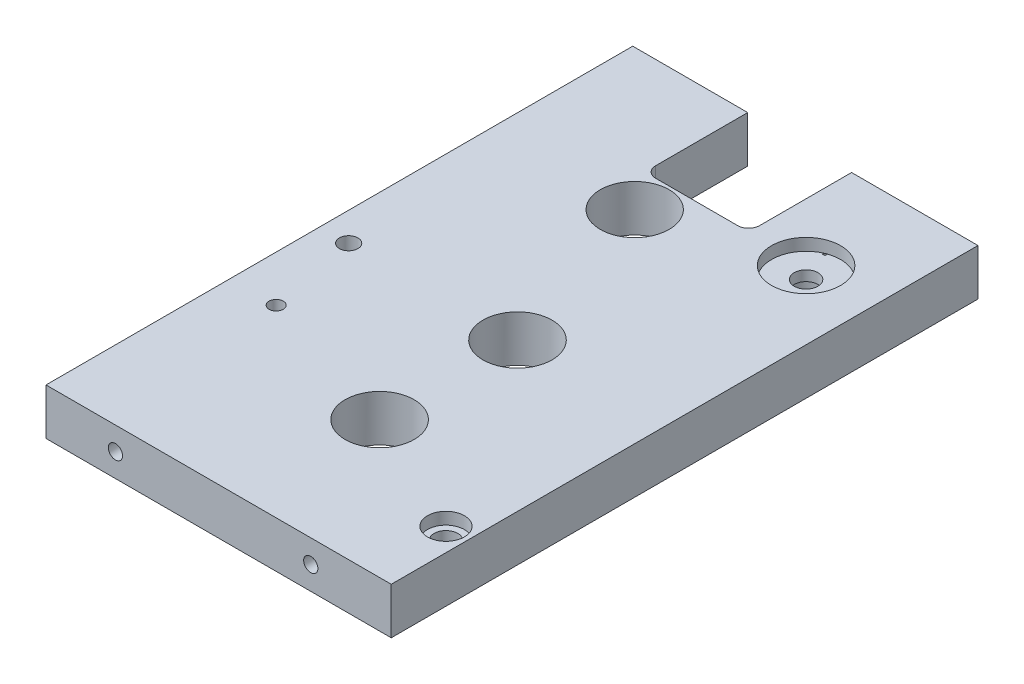
ISO-10303-21;
HEADER;
FILE_DESCRIPTION(('STEP AP214'),'2;1');
FILE_NAME('part.step','',(''),(''),'','','');
FILE_SCHEMA(('AUTOMOTIVE_DESIGN { 1 0 10303 214 1 1 1 1 }'));
ENDSEC;
DATA;
#1=APPLICATION_CONTEXT('core data for automotive mechanical design processes');
#2=APPLICATION_PROTOCOL_DEFINITION('international standard','automotive_design',2000,#1);
#3=PRODUCT_CONTEXT('',#1,'mechanical');
#4=PRODUCT('Part','Part','',(#3));
#5=PRODUCT_RELATED_PRODUCT_CATEGORY('part','',(#4));
#6=PRODUCT_DEFINITION_FORMATION('','',#4);
#7=PRODUCT_DEFINITION_CONTEXT('part definition',#1,'design');
#8=PRODUCT_DEFINITION('design','',#6,#7);
#9=PRODUCT_DEFINITION_SHAPE('','',#8);
#10=(LENGTH_UNIT() NAMED_UNIT(*) SI_UNIT(.MILLI.,.METRE.));
#11=(NAMED_UNIT(*) PLANE_ANGLE_UNIT() SI_UNIT($,.RADIAN.));
#12=(NAMED_UNIT(*) SI_UNIT($,.STERADIAN.) SOLID_ANGLE_UNIT());
#13=UNCERTAINTY_MEASURE_WITH_UNIT(LENGTH_MEASURE(1.E-05),#10,'distance_accuracy_value','');
#14=(GEOMETRIC_REPRESENTATION_CONTEXT(3) GLOBAL_UNCERTAINTY_ASSIGNED_CONTEXT((#13)) GLOBAL_UNIT_ASSIGNED_CONTEXT((#10,
#11,#12)) REPRESENTATION_CONTEXT('',''));
#15=CARTESIAN_POINT('',(0.,0.,0.));
#16=DIRECTION('',(0.,0.,1.));
#17=DIRECTION('',(1.,0.,0.));
#18=AXIS2_PLACEMENT_3D('',#15,#16,#17);
#19=CARTESIAN_POINT('',(-253.55,-622.901,28.505));
#20=DIRECTION('',(0.,1.,0.));
#21=DIRECTION('',(0.,0.,1.));
#22=AXIS2_PLACEMENT_3D('',#19,#20,#21);
#23=CYLINDRICAL_SURFACE('',#22,3.26500000000004);
#24=CARTESIAN_POINT('',(-253.55,-613.42,28.505));
#25=DIRECTION('',(0.,1.,0.));
#26=DIRECTION('',(0.,0.,1.));
#27=AXIS2_PLACEMENT_3D('',#24,#25,#26);
#28=CIRCLE('',#27,3.26500000000004);
#29=CARTESIAN_POINT('',(-253.55,-613.42,31.77));
#30=VERTEX_POINT('',#29);
#31=EDGE_CURVE('E132',#30,#30,#28,.F.);
#32=ORIENTED_EDGE('',*,*,#31,.F.);
#33=EDGE_LOOP('',(#32));
#34=FACE_BOUND('',#33,.T.);
#35=CARTESIAN_POINT('',(-253.55,-616.25,28.505));
#36=DIRECTION('',(0.,-1.,0.));
#37=DIRECTION('',(0.,0.,-1.));
#38=AXIS2_PLACEMENT_3D('',#35,#36,#37);
#39=CIRCLE('',#38,3.26500000000004);
#40=CARTESIAN_POINT('',(-253.55,-616.25,25.24));
#41=VERTEX_POINT('',#40);
#42=EDGE_CURVE('E37',#41,#41,#39,.F.);
#43=ORIENTED_EDGE('',*,*,#42,.F.);
#44=EDGE_LOOP('',(#43));
#45=FACE_BOUND('',#44,.T.);
#46=ADVANCED_FACE('F33',(#34,#45),#23,.F.);
#47=CARTESIAN_POINT('',(-240.925,-622.901,140.49));
#48=DIRECTION('',(0.,1.,0.));
#49=DIRECTION('',(0.,0.,1.));
#50=AXIS2_PLACEMENT_3D('',#47,#48,#49);
#51=CYLINDRICAL_SURFACE('',#50,3.26500000000004);
#52=CARTESIAN_POINT('',(-240.925,-613.42,140.49));
#53=DIRECTION('',(0.,1.,0.));
#54=DIRECTION('',(0.,0.,1.));
#55=AXIS2_PLACEMENT_3D('',#52,#53,#54);
#56=CIRCLE('',#55,3.26500000000004);
#57=CARTESIAN_POINT('',(-240.925,-613.42,143.755));
#58=VERTEX_POINT('',#57);
#59=EDGE_CURVE('E271',#58,#58,#56,.F.);
#60=ORIENTED_EDGE('',*,*,#59,.F.);
#61=EDGE_LOOP('',(#60));
#62=FACE_BOUND('',#61,.T.);
#63=CARTESIAN_POINT('',(-240.925,-616.25,140.49));
#64=DIRECTION('',(0.,-1.,0.));
#65=DIRECTION('',(0.,0.,-1.));
#66=AXIS2_PLACEMENT_3D('',#63,#64,#65);
#67=CIRCLE('',#66,3.26500000000004);
#68=CARTESIAN_POINT('',(-240.925,-616.25,137.225));
#69=VERTEX_POINT('',#68);
#70=EDGE_CURVE('E358',#69,#69,#67,.F.);
#71=ORIENTED_EDGE('',*,*,#70,.F.);
#72=EDGE_LOOP('',(#71));
#73=FACE_BOUND('',#72,.T.);
#74=ADVANCED_FACE('F292',(#62,#73),#51,.F.);
#75=CARTESIAN_POINT('',(-257.,-616.5,20.2));
#76=DIRECTION('',(0.,0.,-1.));
#77=DIRECTION('',(-1.,0.,0.));
#78=AXIS2_PLACEMENT_3D('',#75,#76,#77);
#79=CYLINDRICAL_SURFACE('',#78,3.1);
#80=CARTESIAN_POINT('',(-257.,-616.5,0.));
#81=DIRECTION('',(0.,0.,1.));
#82=DIRECTION('',(1.,0.,0.));
#83=AXIS2_PLACEMENT_3D('',#80,#81,#82);
#84=CIRCLE('',#83,3.1);
#85=CARTESIAN_POINT('',(-253.9,-616.5,0.));
#86=VERTEX_POINT('',#85);
#87=EDGE_CURVE('E218',#86,#86,#84,.T.);
#88=ORIENTED_EDGE('',*,*,#87,.F.);
#89=EDGE_LOOP('',(#88));
#90=FACE_BOUND('',#89,.T.);
#91=CARTESIAN_POINT('',(-257.,-616.5,20.2));
#92=DIRECTION('',(0.,0.,1.));
#93=DIRECTION('',(1.,0.,0.));
#94=AXIS2_PLACEMENT_3D('',#91,#92,#93);
#95=CIRCLE('',#94,3.1);
#96=CARTESIAN_POINT('',(-257.351567916625,-613.42,20.2));
#97=VERTEX_POINT('',#96);
#98=CARTESIAN_POINT('',(-256.648432083375,-613.42,20.2));
#99=VERTEX_POINT('',#98);
#100=EDGE_CURVE('E138',#97,#99,#95,.T.);
#101=ORIENTED_EDGE('',*,*,#100,.T.);
#102=DIRECTION('',(0.,0.,-1.));
#103=VECTOR('',#102,1.);
#104=CARTESIAN_POINT('',(-256.648432083375,-613.42,20.2));
#105=LINE('',#104,#103);
#106=CARTESIAN_POINT('',(-256.648432083375,-613.42,19.4980391571455));
#107=VERTEX_POINT('',#106);
#108=EDGE_CURVE('E50',#99,#107,#105,.T.);
#109=ORIENTED_EDGE('',*,*,#108,.T.);
#110=CARTESIAN_POINT('',(-257.351567916625,-613.42,19.7715180841038));
#111=CARTESIAN_POINT('',(-257.294025252139,-613.413430428197,19.7464680719644));
#112=CARTESIAN_POINT('',(-257.236076859942,-613.40845092462,19.7219228697342));
#113=CARTESIAN_POINT('',(-257.119730101556,-613.401767055608,19.6739985155621));
#114=CARTESIAN_POINT('',(-257.061333756756,-613.400052307867,19.6506158982737));
#115=CARTESIAN_POINT('',(-256.944081841742,-613.399950057355,19.6050118117245));
#116=CARTESIAN_POINT('',(-256.885226256778,-613.401562661886,19.5827903799339));
#117=CARTESIAN_POINT('',(-256.767068214502,-613.408194942094,19.5395060983339));
#118=CARTESIAN_POINT('',(-256.707764930181,-613.413225489289,19.5184471779447));
#119=CARTESIAN_POINT('',(-256.648432083375,-613.42,19.4980391571455));
#120=B_SPLINE_CURVE_WITH_KNOTS('',3,(#110,#111,#112,#113,#114,#115,#116,#117,#118,#119),
.UNSPECIFIED.,.F.,.F.,(4,2,2,2,4),(0.,0.18928759541192,0.377972222019606,0.566662933511772,
0.755956644415914),.UNSPECIFIED.);
#121=CARTESIAN_POINT('',(-257.351567916625,-613.42,19.7715180841038));
#122=VERTEX_POINT('',#121);
#123=EDGE_CURVE('E11',#122,#107,#120,.T.);
#124=ORIENTED_EDGE('',*,*,#123,.F.);
#125=DIRECTION('',(0.,0.,-1.));
#126=VECTOR('',#125,1.);
#127=CARTESIAN_POINT('',(-257.351567916625,-613.42,20.2));
#128=LINE('',#127,#126);
#129=EDGE_CURVE('E131',#122,#97,#128,.F.);
#130=ORIENTED_EDGE('',*,*,#129,.T.);
#131=EDGE_LOOP('',(#101,#109,#124,#130));
#132=FACE_BOUND('',#131,.T.);
#133=ADVANCED_FACE('F136',(#90,#132),#79,.F.);
#134=CARTESIAN_POINT('',(-282.25,-691.394504988286,20.2));
#135=DIRECTION('',(0.,0.,1.));
#136=DIRECTION('',(1.,0.,0.));
#137=AXIS2_PLACEMENT_3D('',#134,#135,#136);
#138=PLANE('',#137);
#139=DIRECTION('',(-1.,0.,0.));
#140=VECTOR('',#139,1.);
#141=CARTESIAN_POINT('',(-282.25,-613.42,20.2));
#142=LINE('',#141,#140);
#143=EDGE_CURVE('E144',#99,#97,#142,.T.);
#144=ORIENTED_EDGE('',*,*,#143,.F.);
#145=ORIENTED_EDGE('',*,*,#100,.F.);
#146=EDGE_LOOP('',(#144,#145));
#147=FACE_BOUND('',#146,.T.);
#148=ADVANCED_FACE('F339',(#147),#138,.F.);
#149=CARTESIAN_POINT('',(-329.875,-610.1,0.));
#150=DIRECTION('',(0.,0.,1.));
#151=DIRECTION('',(1.,0.,0.));
#152=AXIS2_PLACEMENT_3D('',#149,#150,#151);
#153=PLANE('',#152);
#154=ORIENTED_EDGE('',*,*,#87,.T.);
#155=EDGE_LOOP('',(#154));
#156=FACE_BOUND('',#155,.T.);
#157=CARTESIAN_POINT('',(-244.2,-616.5,0.));
#158=DIRECTION('',(0.,0.,1.));
#159=DIRECTION('',(1.,0.,0.));
#160=AXIS2_PLACEMENT_3D('',#157,#158,#159);
#161=CIRCLE('',#160,2.39500000000001);
#162=CARTESIAN_POINT('',(-241.805,-616.5,0.));
#163=VERTEX_POINT('',#162);
#164=EDGE_CURVE('E212',#163,#163,#161,.T.);
#165=ORIENTED_EDGE('',*,*,#164,.T.);
#166=EDGE_LOOP('',(#165));
#167=FACE_BOUND('',#166,.T.);
#168=DIRECTION('',(-1.,0.,0.));
#169=VECTOR('',#168,1.);
#170=CARTESIAN_POINT('',(-234.625,-622.9,0.));
#171=LINE('',#170,#169);
#172=CARTESIAN_POINT('',(-234.625,-622.9,0.));
#173=VERTEX_POINT('',#172);
#174=CARTESIAN_POINT('',(-269.505,-622.9,0.));
#175=VERTEX_POINT('',#174);
#176=EDGE_CURVE('E251',#173,#175,#171,.T.);
#177=ORIENTED_EDGE('',*,*,#176,.T.);
#178=DIRECTION('',(0.,1.,0.));
#179=VECTOR('',#178,1.);
#180=CARTESIAN_POINT('',(-269.505,-622.901,0.));
#181=LINE('',#180,#179);
#182=CARTESIAN_POINT('',(-269.505,-610.1,0.));
#183=VERTEX_POINT('',#182);
#184=EDGE_CURVE('E184',#175,#183,#181,.T.);
#185=ORIENTED_EDGE('',*,*,#184,.T.);
#186=DIRECTION('',(-1.,0.,0.));
#187=VECTOR('',#186,1.);
#188=CARTESIAN_POINT('',(-234.625,-610.1,0.));
#189=LINE('',#188,#187);
#190=CARTESIAN_POINT('',(-234.625,-610.1,0.));
#191=VERTEX_POINT('',#190);
#192=EDGE_CURVE('E244',#191,#183,#189,.T.);
#193=ORIENTED_EDGE('',*,*,#192,.F.);
#194=DIRECTION('',(0.,-1.,0.));
#195=VECTOR('',#194,1.);
#196=CARTESIAN_POINT('',(-234.625,-610.1,0.));
#197=LINE('',#196,#195);
#198=EDGE_CURVE('E235',#191,#173,#197,.T.);
#199=ORIENTED_EDGE('',*,*,#198,.T.);
#200=EDGE_LOOP('',(#177,#185,#193,#199));
#201=FACE_BOUND('',#200,.T.);
#202=ADVANCED_FACE('F341',(#156,#167,#201),#153,.F.);
#203=CARTESIAN_POINT('',(-307.5,-616.5,0.));
#204=DIRECTION('',(0.,0.,1.));
#205=DIRECTION('',(1.,0.,0.));
#206=AXIS2_PLACEMENT_3D('',#203,#204,#205);
#207=CIRCLE('',#206,3.1);
#208=CARTESIAN_POINT('',(-304.4,-616.5,0.));
#209=VERTEX_POINT('',#208);
#210=EDGE_CURVE('E222',#209,#209,#207,.T.);
#211=ORIENTED_EDGE('',*,*,#210,.T.);
#212=EDGE_LOOP('',(#211));
#213=FACE_BOUND('',#212,.T.);
#214=CARTESIAN_POINT('',(-298.155,-610.1,0.));
#215=VERTEX_POINT('',#214);
#216=CARTESIAN_POINT('',(-329.875,-610.1,0.));
#217=VERTEX_POINT('',#216);
#218=EDGE_CURVE('E228',#215,#217,#189,.T.);
#219=ORIENTED_EDGE('',*,*,#218,.F.);
#220=DIRECTION('',(0.,1.,0.));
#221=VECTOR('',#220,1.);
#222=CARTESIAN_POINT('',(-298.155,-622.901,0.));
#223=LINE('',#222,#221);
#224=CARTESIAN_POINT('',(-298.155,-622.9,0.));
#225=VERTEX_POINT('',#224);
#226=EDGE_CURVE('E193',#225,#215,#223,.T.);
#227=ORIENTED_EDGE('',*,*,#226,.F.);
#228=CARTESIAN_POINT('',(-329.875,-622.9,0.));
#229=VERTEX_POINT('',#228);
#230=EDGE_CURVE('E250',#225,#229,#171,.T.);
#231=ORIENTED_EDGE('',*,*,#230,.T.);
#232=DIRECTION('',(0.,-1.,0.));
#233=VECTOR('',#232,1.);
#234=CARTESIAN_POINT('',(-329.875,-610.1,0.));
#235=LINE('',#234,#233);
#236=EDGE_CURVE('E247',#217,#229,#235,.T.);
#237=ORIENTED_EDGE('',*,*,#236,.F.);
#238=EDGE_LOOP('',(#219,#227,#231,#237));
#239=FACE_BOUND('',#238,.T.);
#240=CARTESIAN_POINT('',(-320.5,-616.5,0.));
#241=DIRECTION('',(0.,0.,1.));
#242=DIRECTION('',(1.,0.,0.));
#243=AXIS2_PLACEMENT_3D('',#240,#241,#242);
#244=CIRCLE('',#243,2.39499999999998);
#245=CARTESIAN_POINT('',(-318.105,-616.5,0.));
#246=VERTEX_POINT('',#245);
#247=EDGE_CURVE('E206',#246,#246,#244,.T.);
#248=ORIENTED_EDGE('',*,*,#247,.T.);
#249=EDGE_LOOP('',(#248));
#250=FACE_BOUND('',#249,.T.);
#251=ADVANCED_FACE('F347',(#213,#239,#250),#153,.F.);
#252=CARTESIAN_POINT('',(-234.625,-610.1,161.88));
#253=DIRECTION('',(0.,-1.,0.));
#254=DIRECTION('',(0.,0.,-1.));
#255=AXIS2_PLACEMENT_3D('',#252,#253,#254);
#256=PLANE('',#255);
#257=CARTESIAN_POINT('',(-290.57,-610.1,38.77));
#258=DIRECTION('',(0.,-1.,0.));
#259=DIRECTION('',(0.,0.,-1.));
#260=AXIS2_PLACEMENT_3D('',#257,#258,#259);
#261=CIRCLE('',#260,9.50000000000001);
#262=CARTESIAN_POINT('',(-290.57,-610.1,29.27));
#263=VERTEX_POINT('',#262);
#264=EDGE_CURVE('E389',#263,#263,#261,.T.);
#265=ORIENTED_EDGE('',*,*,#264,.T.);
#266=EDGE_LOOP('',(#265));
#267=FACE_BOUND('',#266,.T.);
#268=CARTESIAN_POINT('',(-240.925,-610.1,140.49));
#269=DIRECTION('',(0.,1.,0.));
#270=DIRECTION('',(0.,0.,1.));
#271=AXIS2_PLACEMENT_3D('',#268,#269,#270);
#272=CIRCLE('',#271,5.09);
#273=CARTESIAN_POINT('',(-240.925,-610.1,145.58));
#274=VERTEX_POINT('',#273);
#275=EDGE_CURVE('E354',#274,#274,#272,.T.);
#276=ORIENTED_EDGE('',*,*,#275,.F.);
#277=EDGE_LOOP('',(#276));
#278=FACE_BOUND('',#277,.T.);
#279=CARTESIAN_POINT('',(-253.55,-610.1,28.505));
#280=DIRECTION('',(0.,1.,0.));
#281=DIRECTION('',(0.,0.,1.));
#282=AXIS2_PLACEMENT_3D('',#279,#280,#281);
#283=CIRCLE('',#282,9.52500000000002);
#284=CARTESIAN_POINT('',(-253.55,-610.1,38.03));
#285=VERTEX_POINT('',#284);
#286=EDGE_CURVE('E133',#285,#285,#283,.T.);
#287=ORIENTED_EDGE('',*,*,#286,.F.);
#288=EDGE_LOOP('',(#287));
#289=FACE_BOUND('',#288,.T.);
#290=CARTESIAN_POINT('',(-321.975,-610.1,86.28));
#291=DIRECTION('',(0.,1.,0.));
#292=DIRECTION('',(0.,0.,1.));
#293=AXIS2_PLACEMENT_3D('',#290,#291,#292);
#294=CIRCLE('',#293,2.56000000000003);
#295=CARTESIAN_POINT('',(-321.975,-610.1,88.84));
#296=VERTEX_POINT('',#295);
#297=EDGE_CURVE('E142',#296,#296,#294,.T.);
#298=ORIENTED_EDGE('',*,*,#297,.F.);
#299=EDGE_LOOP('',(#298));
#300=FACE_BOUND('',#299,.T.);
#301=CARTESIAN_POINT('',(-317.175,-610.1,111.08));
#302=DIRECTION('',(0.,1.,0.));
#303=DIRECTION('',(0.,0.,1.));
#304=AXIS2_PLACEMENT_3D('',#301,#302,#303);
#305=CIRCLE('',#304,1.96000000000001);
#306=CARTESIAN_POINT('',(-317.175,-610.1,113.04));
#307=VERTEX_POINT('',#306);
#308=EDGE_CURVE('E151',#307,#307,#305,.T.);
#309=ORIENTED_EDGE('',*,*,#308,.F.);
#310=EDGE_LOOP('',(#309));
#311=FACE_BOUND('',#310,.T.);
#312=CARTESIAN_POINT('',(-275.57,-610.1,86.105));
#313=DIRECTION('',(0.,1.,0.));
#314=DIRECTION('',(0.,0.,1.));
#315=AXIS2_PLACEMENT_3D('',#312,#313,#314);
#316=CIRCLE('',#315,9.52500000000002);
#317=CARTESIAN_POINT('',(-275.57,-610.1,95.63));
#318=VERTEX_POINT('',#317);
#319=EDGE_CURVE('E197',#318,#318,#316,.T.);
#320=ORIENTED_EDGE('',*,*,#319,.F.);
#321=EDGE_LOOP('',(#320));
#322=FACE_BOUND('',#321,.T.);
#323=CARTESIAN_POINT('',(-275.57,-610.1,124.135));
#324=DIRECTION('',(0.,1.,0.));
#325=DIRECTION('',(0.,0.,1.));
#326=AXIS2_PLACEMENT_3D('',#323,#324,#325);
#327=CIRCLE('',#326,9.52500000000002);
#328=CARTESIAN_POINT('',(-275.57,-610.1,133.66));
#329=VERTEX_POINT('',#328);
#330=EDGE_CURVE('E203',#329,#329,#327,.T.);
#331=ORIENTED_EDGE('',*,*,#330,.F.);
#332=EDGE_LOOP('',(#331));
#333=FACE_BOUND('',#332,.T.);
#334=ORIENTED_EDGE('',*,*,#192,.T.);
#335=DIRECTION('',(0.,0.,-1.));
#336=VECTOR('',#335,1.);
#337=CARTESIAN_POINT('',(-269.505,-610.1,0.));
#338=LINE('',#337,#336);
#339=CARTESIAN_POINT('',(-269.505,-610.1,25.4));
#340=VERTEX_POINT('',#339);
#341=EDGE_CURVE('E171',#340,#183,#338,.T.);
#342=ORIENTED_EDGE('',*,*,#341,.F.);
#343=CARTESIAN_POINT('',(-272.505,-610.1,25.4));
#344=DIRECTION('',(0.,1.,0.));
#345=DIRECTION('',(0.,0.,1.));
#346=AXIS2_PLACEMENT_3D('',#343,#344,#345);
#347=CIRCLE('',#346,3.);
#348=CARTESIAN_POINT('',(-272.505,-610.1,28.4));
#349=VERTEX_POINT('',#348);
#350=EDGE_CURVE('E181',#349,#340,#347,.T.);
#351=ORIENTED_EDGE('',*,*,#350,.F.);
#352=DIRECTION('',(1.,0.,0.));
#353=VECTOR('',#352,1.);
#354=CARTESIAN_POINT('',(-272.505,-610.1,28.4));
#355=LINE('',#354,#353);
#356=CARTESIAN_POINT('',(-295.155,-610.1,28.4));
#357=VERTEX_POINT('',#356);
#358=EDGE_CURVE('E178',#357,#349,#355,.T.);
#359=ORIENTED_EDGE('',*,*,#358,.F.);
#360=CARTESIAN_POINT('',(-295.155,-610.1,25.4));
#361=DIRECTION('',(0.,1.,0.));
#362=DIRECTION('',(0.,0.,1.));
#363=AXIS2_PLACEMENT_3D('',#360,#361,#362);
#364=CIRCLE('',#363,3.);
#365=CARTESIAN_POINT('',(-298.155,-610.1,25.4));
#366=VERTEX_POINT('',#365);
#367=EDGE_CURVE('E175',#366,#357,#364,.T.);
#368=ORIENTED_EDGE('',*,*,#367,.F.);
#369=DIRECTION('',(0.,0.,1.));
#370=VECTOR('',#369,1.);
#371=CARTESIAN_POINT('',(-298.155,-610.1,0.));
#372=LINE('',#371,#370);
#373=EDGE_CURVE('E173',#215,#366,#372,.T.);
#374=ORIENTED_EDGE('',*,*,#373,.F.);
#375=ORIENTED_EDGE('',*,*,#218,.T.);
#376=DIRECTION('',(0.,0.,-1.));
#377=VECTOR('',#376,1.);
#378=CARTESIAN_POINT('',(-329.875,-610.1,161.88));
#379=LINE('',#378,#377);
#380=CARTESIAN_POINT('',(-329.875,-610.1,161.88));
#381=VERTEX_POINT('',#380);
#382=EDGE_CURVE('E42',#381,#217,#379,.T.);
#383=ORIENTED_EDGE('',*,*,#382,.F.);
#384=DIRECTION('',(-1.,0.,0.));
#385=VECTOR('',#384,1.);
#386=CARTESIAN_POINT('',(-234.625,-610.1,161.88));
#387=LINE('',#386,#385);
#388=CARTESIAN_POINT('',(-234.625,-610.1,161.88));
#389=VERTEX_POINT('',#388);
#390=EDGE_CURVE('E231',#389,#381,#387,.T.);
#391=ORIENTED_EDGE('',*,*,#390,.F.);
#392=DIRECTION('',(0.,0.,-1.));
#393=VECTOR('',#392,1.);
#394=CARTESIAN_POINT('',(-234.625,-610.1,161.88));
#395=LINE('',#394,#393);
#396=EDGE_CURVE('E243',#389,#191,#395,.T.);
#397=ORIENTED_EDGE('',*,*,#396,.T.);
#398=EDGE_LOOP('',(#334,#342,#351,#359,#368,#374,#375,#383,#391,#397));
#399=FACE_BOUND('',#398,.T.);
#400=ADVANCED_FACE('F35',(#267,#278,#289,#300,#311,#322,#333,#399),#256,.F.);
#401=CARTESIAN_POINT('',(-329.875,-610.1,161.88));
#402=DIRECTION('',(1.,0.,0.));
#403=DIRECTION('',(0.,0.,-1.));
#404=AXIS2_PLACEMENT_3D('',#401,#402,#403);
#405=PLANE('',#404);
#406=CARTESIAN_POINT('',(-329.875,-616.5,142.28));
#407=DIRECTION('',(-1.,0.,0.));
#408=DIRECTION('',(0.,0.,1.));
#409=AXIS2_PLACEMENT_3D('',#406,#407,#408);
#410=CIRCLE('',#409,1.9699999999999);
#411=CARTESIAN_POINT('',(-329.875,-616.5,144.25));
#412=VERTEX_POINT('',#411);
#413=EDGE_CURVE('E386',#412,#412,#410,.T.);
#414=ORIENTED_EDGE('',*,*,#413,.F.);
#415=EDGE_LOOP('',(#414));
#416=FACE_BOUND('',#415,.T.);
#417=ORIENTED_EDGE('',*,*,#236,.T.);
#418=DIRECTION('',(0.,0.,-1.));
#419=VECTOR('',#418,1.);
#420=CARTESIAN_POINT('',(-329.875,-622.9,161.88));
#421=LINE('',#420,#419);
#422=CARTESIAN_POINT('',(-329.875,-622.9,161.88));
#423=VERTEX_POINT('',#422);
#424=EDGE_CURVE('E259',#423,#229,#421,.T.);
#425=ORIENTED_EDGE('',*,*,#424,.F.);
#426=DIRECTION('',(0.,-1.,0.));
#427=VECTOR('',#426,1.);
#428=CARTESIAN_POINT('',(-329.875,-610.1,161.88));
#429=LINE('',#428,#427);
#430=EDGE_CURVE('E234',#381,#423,#429,.T.);
#431=ORIENTED_EDGE('',*,*,#430,.F.);
#432=ORIENTED_EDGE('',*,*,#382,.T.);
#433=EDGE_LOOP('',(#417,#425,#431,#432));
#434=FACE_BOUND('',#433,.T.);
#435=ADVANCED_FACE('F411',(#416,#434),#405,.F.);
#436=CARTESIAN_POINT('',(-234.625,-622.9,161.88));
#437=DIRECTION('',(0.,-1.,0.));
#438=DIRECTION('',(0.,0.,-1.));
#439=AXIS2_PLACEMENT_3D('',#436,#437,#438);
#440=PLANE('',#439);
#441=CARTESIAN_POINT('',(-290.57,-622.9,38.77));
#442=DIRECTION('',(0.,-1.,0.));
#443=DIRECTION('',(0.,0.,-1.));
#444=AXIS2_PLACEMENT_3D('',#441,#442,#443);
#445=CIRCLE('',#444,9.50000000000001);
#446=CARTESIAN_POINT('',(-290.57,-622.9,29.27));
#447=VERTEX_POINT('',#446);
#448=EDGE_CURVE('E392',#447,#447,#445,.T.);
#449=ORIENTED_EDGE('',*,*,#448,.F.);
#450=EDGE_LOOP('',(#449));
#451=FACE_BOUND('',#450,.T.);
#452=CARTESIAN_POINT('',(-253.55,-622.9,28.505));
#453=DIRECTION('',(0.,-1.,0.));
#454=DIRECTION('',(0.,0.,-1.));
#455=AXIS2_PLACEMENT_3D('',#452,#453,#454);
#456=CIRCLE('',#455,5.31000000000001);
#457=CARTESIAN_POINT('',(-253.55,-622.9,23.195));
#458=VERTEX_POINT('',#457);
#459=EDGE_CURVE('E367',#458,#458,#456,.T.);
#460=ORIENTED_EDGE('',*,*,#459,.F.);
#461=EDGE_LOOP('',(#460));
#462=FACE_BOUND('',#461,.T.);
#463=CARTESIAN_POINT('',(-240.925,-622.9,140.49));
#464=DIRECTION('',(0.,-1.,0.));
#465=DIRECTION('',(0.,0.,-1.));
#466=AXIS2_PLACEMENT_3D('',#463,#464,#465);
#467=CIRCLE('',#466,5.31000000000002);
#468=CARTESIAN_POINT('',(-240.925,-622.9,135.18));
#469=VERTEX_POINT('',#468);
#470=EDGE_CURVE('E361',#469,#469,#467,.T.);
#471=ORIENTED_EDGE('',*,*,#470,.F.);
#472=EDGE_LOOP('',(#471));
#473=FACE_BOUND('',#472,.T.);
#474=CARTESIAN_POINT('',(-321.975,-622.9,86.28));
#475=DIRECTION('',(0.,-1.,0.));
#476=DIRECTION('',(0.,0.,-1.));
#477=AXIS2_PLACEMENT_3D('',#474,#475,#476);
#478=CIRCLE('',#477,2.56000000000003);
#479=CARTESIAN_POINT('',(-321.975,-622.9,83.72));
#480=VERTEX_POINT('',#479);
#481=EDGE_CURVE('E139',#480,#480,#478,.F.);
#482=ORIENTED_EDGE('',*,*,#481,.T.);
#483=EDGE_LOOP('',(#482));
#484=FACE_BOUND('',#483,.T.);
#485=CARTESIAN_POINT('',(-317.175,-622.9,111.08));
#486=DIRECTION('',(0.,-1.,0.));
#487=DIRECTION('',(0.,0.,-1.));
#488=AXIS2_PLACEMENT_3D('',#485,#486,#487);
#489=CIRCLE('',#488,1.96000000000001);
#490=CARTESIAN_POINT('',(-317.175,-622.9,109.12));
#491=VERTEX_POINT('',#490);
#492=EDGE_CURVE('E149',#491,#491,#489,.F.);
#493=ORIENTED_EDGE('',*,*,#492,.T.);
#494=EDGE_LOOP('',(#493));
#495=FACE_BOUND('',#494,.T.);
#496=DIRECTION('',(0.,0.,-1.));
#497=VECTOR('',#496,1.);
#498=CARTESIAN_POINT('',(-269.505,-622.9,0.));
#499=LINE('',#498,#497);
#500=CARTESIAN_POINT('',(-269.505,-622.9,25.4));
#501=VERTEX_POINT('',#500);
#502=EDGE_CURVE('E168',#501,#175,#499,.T.);
#503=ORIENTED_EDGE('',*,*,#502,.T.);
#504=ORIENTED_EDGE('',*,*,#176,.F.);
#505=DIRECTION('',(0.,0.,-1.));
#506=VECTOR('',#505,1.);
#507=CARTESIAN_POINT('',(-234.625,-622.9,161.88));
#508=LINE('',#507,#506);
#509=CARTESIAN_POINT('',(-234.625,-622.9,161.88));
#510=VERTEX_POINT('',#509);
#511=EDGE_CURVE('E257',#510,#173,#508,.T.);
#512=ORIENTED_EDGE('',*,*,#511,.F.);
#513=DIRECTION('',(-1.,0.,0.));
#514=VECTOR('',#513,1.);
#515=CARTESIAN_POINT('',(-234.625,-622.9,161.88));
#516=LINE('',#515,#514);
#517=EDGE_CURVE('E237',#510,#423,#516,.T.);
#518=ORIENTED_EDGE('',*,*,#517,.T.);
#519=ORIENTED_EDGE('',*,*,#424,.T.);
#520=ORIENTED_EDGE('',*,*,#230,.F.);
#521=DIRECTION('',(0.,0.,1.));
#522=VECTOR('',#521,1.);
#523=CARTESIAN_POINT('',(-298.155,-622.9,0.));
#524=LINE('',#523,#522);
#525=CARTESIAN_POINT('',(-298.155,-622.9,25.4));
#526=VERTEX_POINT('',#525);
#527=EDGE_CURVE('E154',#225,#526,#524,.T.);
#528=ORIENTED_EDGE('',*,*,#527,.T.);
#529=CARTESIAN_POINT('',(-295.155,-622.9,25.4));
#530=DIRECTION('',(0.,-1.,0.));
#531=DIRECTION('',(0.,0.,-1.));
#532=AXIS2_PLACEMENT_3D('',#529,#530,#531);
#533=CIRCLE('',#532,3.);
#534=CARTESIAN_POINT('',(-295.155,-622.9,28.4));
#535=VERTEX_POINT('',#534);
#536=EDGE_CURVE('E159',#526,#535,#533,.F.);
#537=ORIENTED_EDGE('',*,*,#536,.T.);
#538=DIRECTION('',(1.,0.,0.));
#539=VECTOR('',#538,1.);
#540=CARTESIAN_POINT('',(-272.505,-622.9,28.4));
#541=LINE('',#540,#539);
#542=CARTESIAN_POINT('',(-272.505,-622.9,28.4));
#543=VERTEX_POINT('',#542);
#544=EDGE_CURVE('E162',#535,#543,#541,.T.);
#545=ORIENTED_EDGE('',*,*,#544,.T.);
#546=CARTESIAN_POINT('',(-272.505,-622.9,25.4));
#547=DIRECTION('',(0.,-1.,0.));
#548=DIRECTION('',(0.,0.,-1.));
#549=AXIS2_PLACEMENT_3D('',#546,#547,#548);
#550=CIRCLE('',#549,3.);
#551=EDGE_CURVE('E165',#543,#501,#550,.F.);
#552=ORIENTED_EDGE('',*,*,#551,.T.);
#553=EDGE_LOOP('',(#503,#504,#512,#518,#519,#520,#528,#537,#545,#552));
#554=FACE_BOUND('',#553,.T.);
#555=CARTESIAN_POINT('',(-275.57,-622.9,86.105));
#556=DIRECTION('',(0.,-1.,0.));
#557=DIRECTION('',(0.,0.,-1.));
#558=AXIS2_PLACEMENT_3D('',#555,#556,#557);
#559=CIRCLE('',#558,9.52500000000002);
#560=CARTESIAN_POINT('',(-275.57,-622.9,76.58));
#561=VERTEX_POINT('',#560);
#562=EDGE_CURVE('E187',#561,#561,#559,.F.);
#563=ORIENTED_EDGE('',*,*,#562,.T.);
#564=EDGE_LOOP('',(#563));
#565=FACE_BOUND('',#564,.T.);
#566=CARTESIAN_POINT('',(-275.57,-622.9,124.135));
#567=DIRECTION('',(0.,-1.,0.));
#568=DIRECTION('',(0.,0.,-1.));
#569=AXIS2_PLACEMENT_3D('',#566,#567,#568);
#570=CIRCLE('',#569,9.52500000000002);
#571=CARTESIAN_POINT('',(-275.57,-622.9,114.61));
#572=VERTEX_POINT('',#571);
#573=EDGE_CURVE('E200',#572,#572,#570,.F.);
#574=ORIENTED_EDGE('',*,*,#573,.T.);
#575=EDGE_LOOP('',(#574));
#576=FACE_BOUND('',#575,.T.);
#577=ADVANCED_FACE('F407',(#451,#462,#473,#484,#495,#554,#565,#576),#440,.T.);
#578=CARTESIAN_POINT('',(-234.625,-610.1,161.88));
#579=DIRECTION('',(1.,0.,0.));
#580=DIRECTION('',(0.,0.,-1.));
#581=AXIS2_PLACEMENT_3D('',#578,#579,#580);
#582=PLANE('',#581);
#583=ORIENTED_EDGE('',*,*,#198,.F.);
#584=ORIENTED_EDGE('',*,*,#396,.F.);
#585=DIRECTION('',(0.,-1.,0.));
#586=VECTOR('',#585,1.);
#587=CARTESIAN_POINT('',(-234.625,-610.1,161.88));
#588=LINE('',#587,#586);
#589=EDGE_CURVE('E240',#389,#510,#588,.T.);
#590=ORIENTED_EDGE('',*,*,#589,.T.);
#591=ORIENTED_EDGE('',*,*,#511,.T.);
#592=EDGE_LOOP('',(#583,#584,#590,#591));
#593=FACE_BOUND('',#592,.T.);
#594=ADVANCED_FACE('F410',(#593),#582,.T.);
#595=CARTESIAN_POINT('',(-329.875,-610.1,161.88));
#596=DIRECTION('',(0.,0.,1.));
#597=DIRECTION('',(1.,0.,0.));
#598=AXIS2_PLACEMENT_3D('',#595,#596,#597);
#599=PLANE('',#598);
#600=CARTESIAN_POINT('',(-256.825,-616.48,161.88));
#601=DIRECTION('',(0.,0.,1.));
#602=DIRECTION('',(1.,0.,0.));
#603=AXIS2_PLACEMENT_3D('',#600,#601,#602);
#604=CIRCLE('',#603,1.965);
#605=CARTESIAN_POINT('',(-254.86,-616.48,161.88));
#606=VERTEX_POINT('',#605);
#607=EDGE_CURVE('E380',#606,#606,#604,.T.);
#608=ORIENTED_EDGE('',*,*,#607,.F.);
#609=EDGE_LOOP('',(#608));
#610=FACE_BOUND('',#609,.T.);
#611=CARTESIAN_POINT('',(-310.715,-616.48,161.88));
#612=DIRECTION('',(0.,0.,1.));
#613=DIRECTION('',(1.,0.,0.));
#614=AXIS2_PLACEMENT_3D('',#611,#612,#613);
#615=CIRCLE('',#614,1.965);
#616=CARTESIAN_POINT('',(-308.75,-616.48,161.88));
#617=VERTEX_POINT('',#616);
#618=EDGE_CURVE('E374',#617,#617,#615,.T.);
#619=ORIENTED_EDGE('',*,*,#618,.F.);
#620=EDGE_LOOP('',(#619));
#621=FACE_BOUND('',#620,.T.);
#622=ORIENTED_EDGE('',*,*,#390,.T.);
#623=ORIENTED_EDGE('',*,*,#430,.T.);
#624=ORIENTED_EDGE('',*,*,#517,.F.);
#625=ORIENTED_EDGE('',*,*,#589,.F.);
#626=EDGE_LOOP('',(#622,#623,#624,#625));
#627=FACE_BOUND('',#626,.T.);
#628=ADVANCED_FACE('F441',(#610,#621,#627),#599,.T.);
#629=CARTESIAN_POINT('',(-307.5,-616.5,20.2));
#630=DIRECTION('',(0.,0.,-1.));
#631=DIRECTION('',(-1.,0.,0.));
#632=AXIS2_PLACEMENT_3D('',#629,#630,#631);
#633=CYLINDRICAL_SURFACE('',#632,3.1);
#634=CARTESIAN_POINT('',(-307.5,-616.5,20.2));
#635=DIRECTION('',(0.,0.,1.));
#636=DIRECTION('',(1.,0.,0.));
#637=AXIS2_PLACEMENT_3D('',#634,#635,#636);
#638=CIRCLE('',#637,3.1);
#639=CARTESIAN_POINT('',(-304.4,-616.5,20.2));
#640=VERTEX_POINT('',#639);
#641=EDGE_CURVE('E225',#640,#640,#638,.T.);
#642=ORIENTED_EDGE('',*,*,#641,.T.);
#643=EDGE_LOOP('',(#642));
#644=FACE_BOUND('',#643,.T.);
#645=ORIENTED_EDGE('',*,*,#210,.F.);
#646=EDGE_LOOP('',(#645));
#647=FACE_BOUND('',#646,.T.);
#648=ADVANCED_FACE('F625',(#644,#647),#633,.F.);
#649=CARTESIAN_POINT('',(-282.25,-691.394504988286,20.2));
#650=DIRECTION('',(0.,0.,1.));
#651=DIRECTION('',(1.,0.,0.));
#652=AXIS2_PLACEMENT_3D('',#649,#650,#651);
#653=PLANE('',#652);
#654=ORIENTED_EDGE('',*,*,#641,.F.);
#655=EDGE_LOOP('',(#654));
#656=FACE_BOUND('',#655,.T.);
#657=ADVANCED_FACE('F337',(#656),#653,.F.);
#658=CARTESIAN_POINT('',(-244.2,-616.5,21.5));
#659=DIRECTION('',(0.,0.,-1.));
#660=DIRECTION('',(-1.,0.,0.));
#661=AXIS2_PLACEMENT_3D('',#658,#659,#660);
#662=CYLINDRICAL_SURFACE('',#661,2.39500000000001);
#663=CARTESIAN_POINT('',(-244.2,-616.5,21.5));
#664=DIRECTION('',(0.,0.,1.));
#665=DIRECTION('',(1.,0.,0.));
#666=AXIS2_PLACEMENT_3D('',#663,#664,#665);
#667=CIRCLE('',#666,2.39500000000001);
#668=CARTESIAN_POINT('',(-241.805,-616.5,21.5));
#669=VERTEX_POINT('',#668);
#670=EDGE_CURVE('E215',#669,#669,#667,.T.);
#671=ORIENTED_EDGE('',*,*,#670,.T.);
#672=EDGE_LOOP('',(#671));
#673=FACE_BOUND('',#672,.T.);
#674=ORIENTED_EDGE('',*,*,#164,.F.);
#675=EDGE_LOOP('',(#674));
#676=FACE_BOUND('',#675,.T.);
#677=ADVANCED_FACE('F334',(#673,#676),#662,.F.);
#678=CARTESIAN_POINT('',(-282.25,-691.394504988286,21.5));
#679=DIRECTION('',(0.,0.,1.));
#680=DIRECTION('',(1.,0.,0.));
#681=AXIS2_PLACEMENT_3D('',#678,#679,#680);
#682=PLANE('',#681);
#683=ORIENTED_EDGE('',*,*,#670,.F.);
#684=EDGE_LOOP('',(#683));
#685=FACE_BOUND('',#684,.T.);
#686=ADVANCED_FACE('F330',(#685),#682,.F.);
#687=CARTESIAN_POINT('',(-320.5,-616.5,21.5));
#688=DIRECTION('',(0.,0.,-1.));
#689=DIRECTION('',(-1.,0.,0.));
#690=AXIS2_PLACEMENT_3D('',#687,#688,#689);
#691=CYLINDRICAL_SURFACE('',#690,2.39499999999998);
#692=CARTESIAN_POINT('',(-320.5,-616.5,21.5));
#693=DIRECTION('',(0.,0.,1.));
#694=DIRECTION('',(1.,0.,0.));
#695=AXIS2_PLACEMENT_3D('',#692,#693,#694);
#696=CIRCLE('',#695,2.39499999999998);
#697=CARTESIAN_POINT('',(-318.105,-616.5,21.5));
#698=VERTEX_POINT('',#697);
#699=EDGE_CURVE('E209',#698,#698,#696,.T.);
#700=ORIENTED_EDGE('',*,*,#699,.T.);
#701=EDGE_LOOP('',(#700));
#702=FACE_BOUND('',#701,.T.);
#703=ORIENTED_EDGE('',*,*,#247,.F.);
#704=EDGE_LOOP('',(#703));
#705=FACE_BOUND('',#704,.T.);
#706=ADVANCED_FACE('F326',(#702,#705),#691,.F.);
#707=CARTESIAN_POINT('',(-282.25,-691.394504988286,21.5));
#708=DIRECTION('',(0.,0.,1.));
#709=DIRECTION('',(1.,0.,0.));
#710=AXIS2_PLACEMENT_3D('',#707,#708,#709);
#711=PLANE('',#710);
#712=ORIENTED_EDGE('',*,*,#699,.F.);
#713=EDGE_LOOP('',(#712));
#714=FACE_BOUND('',#713,.T.);
#715=ADVANCED_FACE('F322',(#714),#711,.F.);
#716=CARTESIAN_POINT('',(-275.57,-622.901,124.135));
#717=DIRECTION('',(0.,1.,0.));
#718=DIRECTION('',(0.,0.,1.));
#719=AXIS2_PLACEMENT_3D('',#716,#717,#718);
#720=CYLINDRICAL_SURFACE('',#719,9.52500000000002);
#721=ORIENTED_EDGE('',*,*,#573,.F.);
#722=EDGE_LOOP('',(#721));
#723=FACE_BOUND('',#722,.T.);
#724=ORIENTED_EDGE('',*,*,#330,.T.);
#725=EDGE_LOOP('',(#724));
#726=FACE_BOUND('',#725,.T.);
#727=ADVANCED_FACE('F318',(#723,#726),#720,.F.);
#728=CARTESIAN_POINT('',(-275.57,-622.901,86.105));
#729=DIRECTION('',(0.,1.,0.));
#730=DIRECTION('',(0.,0.,1.));
#731=AXIS2_PLACEMENT_3D('',#728,#729,#730);
#732=CYLINDRICAL_SURFACE('',#731,9.52500000000002);
#733=ORIENTED_EDGE('',*,*,#562,.F.);
#734=EDGE_LOOP('',(#733));
#735=FACE_BOUND('',#734,.T.);
#736=ORIENTED_EDGE('',*,*,#319,.T.);
#737=EDGE_LOOP('',(#736));
#738=FACE_BOUND('',#737,.T.);
#739=ADVANCED_FACE('F314',(#735,#738),#732,.F.);
#740=CARTESIAN_POINT('',(-269.505,-622.901,0.));
#741=DIRECTION('',(1.,0.,0.));
#742=DIRECTION('',(0.,0.,-1.));
#743=AXIS2_PLACEMENT_3D('',#740,#741,#742);
#744=PLANE('',#743);
#745=DIRECTION('',(0.,1.,0.));
#746=VECTOR('',#745,1.);
#747=CARTESIAN_POINT('',(-269.505,-622.901,25.4));
#748=LINE('',#747,#746);
#749=EDGE_CURVE('E185',#501,#340,#748,.T.);
#750=ORIENTED_EDGE('',*,*,#749,.T.);
#751=ORIENTED_EDGE('',*,*,#341,.T.);
#752=ORIENTED_EDGE('',*,*,#184,.F.);
#753=ORIENTED_EDGE('',*,*,#502,.F.);
#754=EDGE_LOOP('',(#750,#751,#752,#753));
#755=FACE_BOUND('',#754,.T.);
#756=ADVANCED_FACE('F301',(#755),#744,.F.);
#757=CARTESIAN_POINT('',(-272.505,-622.901,25.4));
#758=DIRECTION('',(0.,1.,0.));
#759=DIRECTION('',(0.,0.,1.));
#760=AXIS2_PLACEMENT_3D('',#757,#758,#759);
#761=CYLINDRICAL_SURFACE('',#760,3.);
#762=DIRECTION('',(0.,1.,0.));
#763=VECTOR('',#762,1.);
#764=CARTESIAN_POINT('',(-272.505,-622.901,28.4));
#765=LINE('',#764,#763);
#766=EDGE_CURVE('E188',#543,#349,#765,.T.);
#767=ORIENTED_EDGE('',*,*,#766,.T.);
#768=ORIENTED_EDGE('',*,*,#350,.T.);
#769=ORIENTED_EDGE('',*,*,#749,.F.);
#770=ORIENTED_EDGE('',*,*,#551,.F.);
#771=EDGE_LOOP('',(#767,#768,#769,#770));
#772=FACE_BOUND('',#771,.T.);
#773=ADVANCED_FACE('F297',(#772),#761,.F.);
#774=CARTESIAN_POINT('',(-272.505,-622.901,28.4));
#775=DIRECTION('',(0.,0.,1.));
#776=DIRECTION('',(1.,0.,0.));
#777=AXIS2_PLACEMENT_3D('',#774,#775,#776);
#778=PLANE('',#777);
#779=DIRECTION('',(0.,1.,0.));
#780=VECTOR('',#779,1.);
#781=CARTESIAN_POINT('',(-295.155,-622.901,28.4));
#782=LINE('',#781,#780);
#783=EDGE_CURVE('E190',#535,#357,#782,.T.);
#784=ORIENTED_EDGE('',*,*,#783,.T.);
#785=ORIENTED_EDGE('',*,*,#358,.T.);
#786=ORIENTED_EDGE('',*,*,#766,.F.);
#787=ORIENTED_EDGE('',*,*,#544,.F.);
#788=EDGE_LOOP('',(#784,#785,#786,#787));
#789=FACE_BOUND('',#788,.T.);
#790=ADVANCED_FACE('F300',(#789),#778,.F.);
#791=CARTESIAN_POINT('',(-295.155,-622.901,25.4));
#792=DIRECTION('',(0.,1.,0.));
#793=DIRECTION('',(0.,0.,1.));
#794=AXIS2_PLACEMENT_3D('',#791,#792,#793);
#795=CYLINDRICAL_SURFACE('',#794,3.);
#796=DIRECTION('',(0.,1.,0.));
#797=VECTOR('',#796,1.);
#798=CARTESIAN_POINT('',(-298.155,-622.901,25.4));
#799=LINE('',#798,#797);
#800=EDGE_CURVE('E58',#526,#366,#799,.T.);
#801=ORIENTED_EDGE('',*,*,#800,.T.);
#802=ORIENTED_EDGE('',*,*,#367,.T.);
#803=ORIENTED_EDGE('',*,*,#783,.F.);
#804=ORIENTED_EDGE('',*,*,#536,.F.);
#805=EDGE_LOOP('',(#801,#802,#803,#804));
#806=FACE_BOUND('',#805,.T.);
#807=ADVANCED_FACE('F305',(#806),#795,.F.);
#808=CARTESIAN_POINT('',(-298.155,-622.901,0.));
#809=DIRECTION('',(-1.,0.,0.));
#810=DIRECTION('',(0.,0.,1.));
#811=AXIS2_PLACEMENT_3D('',#808,#809,#810);
#812=PLANE('',#811);
#813=ORIENTED_EDGE('',*,*,#226,.T.);
#814=ORIENTED_EDGE('',*,*,#373,.T.);
#815=ORIENTED_EDGE('',*,*,#800,.F.);
#816=ORIENTED_EDGE('',*,*,#527,.F.);
#817=EDGE_LOOP('',(#813,#814,#815,#816));
#818=FACE_BOUND('',#817,.T.);
#819=ADVANCED_FACE('F288',(#818),#812,.F.);
#820=CARTESIAN_POINT('',(-317.175,-622.901,111.08));
#821=DIRECTION('',(0.,1.,0.));
#822=DIRECTION('',(0.,0.,1.));
#823=AXIS2_PLACEMENT_3D('',#820,#821,#822);
#824=CYLINDRICAL_SURFACE('',#823,1.96000000000001);
#825=ORIENTED_EDGE('',*,*,#492,.F.);
#826=EDGE_LOOP('',(#825));
#827=FACE_BOUND('',#826,.T.);
#828=ORIENTED_EDGE('',*,*,#308,.T.);
#829=EDGE_LOOP('',(#828));
#830=FACE_BOUND('',#829,.T.);
#831=ADVANCED_FACE('F284',(#827,#830),#824,.F.);
#832=CARTESIAN_POINT('',(-321.975,-622.901,86.28));
#833=DIRECTION('',(0.,1.,0.));
#834=DIRECTION('',(0.,0.,1.));
#835=AXIS2_PLACEMENT_3D('',#832,#833,#834);
#836=CYLINDRICAL_SURFACE('',#835,2.56000000000003);
#837=ORIENTED_EDGE('',*,*,#481,.F.);
#838=EDGE_LOOP('',(#837));
#839=FACE_BOUND('',#838,.T.);
#840=ORIENTED_EDGE('',*,*,#297,.T.);
#841=EDGE_LOOP('',(#840));
#842=FACE_BOUND('',#841,.T.);
#843=ADVANCED_FACE('F281',(#839,#842),#836,.F.);
#844=CARTESIAN_POINT('',(-253.55,-613.42,28.505));
#845=DIRECTION('',(0.,1.,0.));
#846=DIRECTION('',(0.,0.,1.));
#847=AXIS2_PLACEMENT_3D('',#844,#845,#846);
#848=PLANE('',#847);
#849=ORIENTED_EDGE('',*,*,#143,.T.);
#850=ORIENTED_EDGE('',*,*,#129,.F.);
#851=CARTESIAN_POINT('',(-253.55,-613.42,28.505));
#852=DIRECTION('',(0.,1.,0.));
#853=DIRECTION('',(0.,0.,1.));
#854=AXIS2_PLACEMENT_3D('',#851,#852,#853);
#855=CIRCLE('',#854,9.52500000000002);
#856=EDGE_CURVE('E126',#122,#107,#855,.T.);
#857=ORIENTED_EDGE('',*,*,#856,.T.);
#858=ORIENTED_EDGE('',*,*,#108,.F.);
#859=EDGE_LOOP('',(#849,#850,#857,#858));
#860=FACE_BOUND('',#859,.T.);
#861=ORIENTED_EDGE('',*,*,#31,.T.);
#862=EDGE_LOOP('',(#861));
#863=FACE_BOUND('',#862,.T.);
#864=ADVANCED_FACE('F129',(#860,#863),#848,.T.);
#865=CARTESIAN_POINT('',(-253.55,-613.42,28.505));
#866=DIRECTION('',(0.,1.,0.));
#867=DIRECTION('',(0.,0.,1.));
#868=AXIS2_PLACEMENT_3D('',#865,#866,#867);
#869=CYLINDRICAL_SURFACE('',#868,9.52500000000002);
#870=ORIENTED_EDGE('',*,*,#123,.T.);
#871=ORIENTED_EDGE('',*,*,#856,.F.);
#872=EDGE_LOOP('',(#870,#871));
#873=FACE_BOUND('',#872,.T.);
#874=ORIENTED_EDGE('',*,*,#286,.T.);
#875=EDGE_LOOP('',(#874));
#876=FACE_BOUND('',#875,.T.);
#877=ADVANCED_FACE('F124',(#873,#876),#869,.F.);
#878=CARTESIAN_POINT('',(-240.925,-613.42,140.49));
#879=DIRECTION('',(0.,1.,0.));
#880=DIRECTION('',(0.,0.,1.));
#881=AXIS2_PLACEMENT_3D('',#878,#879,#880);
#882=PLANE('',#881);
#883=CARTESIAN_POINT('',(-240.925,-613.42,140.49));
#884=DIRECTION('',(0.,1.,0.));
#885=DIRECTION('',(0.,0.,1.));
#886=AXIS2_PLACEMENT_3D('',#883,#884,#885);
#887=CIRCLE('',#886,5.09);
#888=CARTESIAN_POINT('',(-240.925,-613.42,145.58));
#889=VERTEX_POINT('',#888);
#890=EDGE_CURVE('E357',#889,#889,#887,.T.);
#891=ORIENTED_EDGE('',*,*,#890,.T.);
#892=EDGE_LOOP('',(#891));
#893=FACE_BOUND('',#892,.T.);
#894=ORIENTED_EDGE('',*,*,#59,.T.);
#895=EDGE_LOOP('',(#894));
#896=FACE_BOUND('',#895,.T.);
#897=ADVANCED_FACE('F279',(#893,#896),#882,.T.);
#898=CARTESIAN_POINT('',(-240.925,-613.42,140.49));
#899=DIRECTION('',(0.,1.,0.));
#900=DIRECTION('',(0.,0.,1.));
#901=AXIS2_PLACEMENT_3D('',#898,#899,#900);
#902=CYLINDRICAL_SURFACE('',#901,5.09);
#903=ORIENTED_EDGE('',*,*,#890,.F.);
#904=EDGE_LOOP('',(#903));
#905=FACE_BOUND('',#904,.T.);
#906=ORIENTED_EDGE('',*,*,#275,.T.);
#907=EDGE_LOOP('',(#906));
#908=FACE_BOUND('',#907,.T.);
#909=ADVANCED_FACE('F512',(#905,#908),#902,.F.);
#910=CARTESIAN_POINT('',(-240.925,-616.25,140.49));
#911=DIRECTION('',(0.,-1.,0.));
#912=DIRECTION('',(0.,0.,-1.));
#913=AXIS2_PLACEMENT_3D('',#910,#911,#912);
#914=PLANE('',#913);
#915=CARTESIAN_POINT('',(-240.925,-616.25,140.49));
#916=DIRECTION('',(0.,-1.,0.));
#917=DIRECTION('',(0.,0.,-1.));
#918=AXIS2_PLACEMENT_3D('',#915,#916,#917);
#919=CIRCLE('',#918,5.31000000000002);
#920=CARTESIAN_POINT('',(-240.925,-616.25,135.18));
#921=VERTEX_POINT('',#920);
#922=EDGE_CURVE('E364',#921,#921,#919,.T.);
#923=ORIENTED_EDGE('',*,*,#922,.T.);
#924=EDGE_LOOP('',(#923));
#925=FACE_BOUND('',#924,.T.);
#926=ORIENTED_EDGE('',*,*,#70,.T.);
#927=EDGE_LOOP('',(#926));
#928=FACE_BOUND('',#927,.T.);
#929=ADVANCED_FACE('F509',(#925,#928),#914,.T.);
#930=CARTESIAN_POINT('',(-240.925,-616.25,140.49));
#931=DIRECTION('',(0.,-1.,0.));
#932=DIRECTION('',(0.,0.,-1.));
#933=AXIS2_PLACEMENT_3D('',#930,#931,#932);
#934=CYLINDRICAL_SURFACE('',#933,5.31000000000002);
#935=ORIENTED_EDGE('',*,*,#922,.F.);
#936=EDGE_LOOP('',(#935));
#937=FACE_BOUND('',#936,.T.);
#938=ORIENTED_EDGE('',*,*,#470,.T.);
#939=EDGE_LOOP('',(#938));
#940=FACE_BOUND('',#939,.T.);
#941=ADVANCED_FACE('F504',(#937,#940),#934,.F.);
#942=CARTESIAN_POINT('',(-253.55,-616.25,28.505));
#943=DIRECTION('',(0.,-1.,0.));
#944=DIRECTION('',(0.,0.,-1.));
#945=AXIS2_PLACEMENT_3D('',#942,#943,#944);
#946=PLANE('',#945);
#947=CARTESIAN_POINT('',(-253.55,-616.25,28.505));
#948=DIRECTION('',(0.,-1.,0.));
#949=DIRECTION('',(0.,0.,-1.));
#950=AXIS2_PLACEMENT_3D('',#947,#948,#949);
#951=CIRCLE('',#950,5.31000000000001);
#952=CARTESIAN_POINT('',(-253.55,-616.25,23.195));
#953=VERTEX_POINT('',#952);
#954=EDGE_CURVE('E370',#953,#953,#951,.T.);
#955=ORIENTED_EDGE('',*,*,#954,.T.);
#956=EDGE_LOOP('',(#955));
#957=FACE_BOUND('',#956,.T.);
#958=ORIENTED_EDGE('',*,*,#42,.T.);
#959=EDGE_LOOP('',(#958));
#960=FACE_BOUND('',#959,.T.);
#961=ADVANCED_FACE('F501',(#957,#960),#946,.T.);
#962=CARTESIAN_POINT('',(-253.55,-616.25,28.505));
#963=DIRECTION('',(0.,-1.,0.));
#964=DIRECTION('',(0.,0.,-1.));
#965=AXIS2_PLACEMENT_3D('',#962,#963,#964);
#966=CYLINDRICAL_SURFACE('',#965,5.31000000000001);
#967=ORIENTED_EDGE('',*,*,#954,.F.);
#968=EDGE_LOOP('',(#967));
#969=FACE_BOUND('',#968,.T.);
#970=ORIENTED_EDGE('',*,*,#459,.T.);
#971=EDGE_LOOP('',(#970));
#972=FACE_BOUND('',#971,.T.);
#973=ADVANCED_FACE('F499',(#969,#972),#966,.F.);
#974=CARTESIAN_POINT('',(-310.715,-616.48,144.63));
#975=DIRECTION('',(0.,0.,1.));
#976=DIRECTION('',(1.,0.,0.));
#977=AXIS2_PLACEMENT_3D('',#974,#975,#976);
#978=CYLINDRICAL_SURFACE('',#977,1.965);
#979=CARTESIAN_POINT('',(-310.715,-616.48,144.63));
#980=DIRECTION('',(0.,0.,1.));
#981=DIRECTION('',(1.,0.,0.));
#982=AXIS2_PLACEMENT_3D('',#979,#980,#981);
#983=CIRCLE('',#982,1.965);
#984=CARTESIAN_POINT('',(-308.75,-616.48,144.63));
#985=VERTEX_POINT('',#984);
#986=EDGE_CURVE('E371',#985,#985,#983,.T.);
#987=ORIENTED_EDGE('',*,*,#986,.F.);
#988=EDGE_LOOP('',(#987));
#989=FACE_BOUND('',#988,.T.);
#990=ORIENTED_EDGE('',*,*,#618,.T.);
#991=EDGE_LOOP('',(#990));
#992=FACE_BOUND('',#991,.T.);
#993=ADVANCED_FACE('F495',(#989,#992),#978,.F.);
#994=CARTESIAN_POINT('',(-310.715,-616.48,144.63));
#995=DIRECTION('',(0.,0.,1.));
#996=DIRECTION('',(1.,0.,0.));
#997=AXIS2_PLACEMENT_3D('',#994,#995,#996);
#998=PLANE('',#997);
#999=ORIENTED_EDGE('',*,*,#986,.T.);
#1000=EDGE_LOOP('',(#999));
#1001=FACE_BOUND('',#1000,.T.);
#1002=ADVANCED_FACE('F491',(#1001),#998,.T.);
#1003=CARTESIAN_POINT('',(-256.825,-616.48,144.63));
#1004=DIRECTION('',(0.,0.,1.));
#1005=DIRECTION('',(1.,0.,0.));
#1006=AXIS2_PLACEMENT_3D('',#1003,#1004,#1005);
#1007=CYLINDRICAL_SURFACE('',#1006,1.965);
#1008=CARTESIAN_POINT('',(-256.825,-616.48,144.63));
#1009=DIRECTION('',(0.,0.,1.));
#1010=DIRECTION('',(1.,0.,0.));
#1011=AXIS2_PLACEMENT_3D('',#1008,#1009,#1010);
#1012=CIRCLE('',#1011,1.965);
#1013=CARTESIAN_POINT('',(-254.86,-616.48,144.63));
#1014=VERTEX_POINT('',#1013);
#1015=EDGE_CURVE('E377',#1014,#1014,#1012,.T.);
#1016=ORIENTED_EDGE('',*,*,#1015,.F.);
#1017=EDGE_LOOP('',(#1016));
#1018=FACE_BOUND('',#1017,.T.);
#1019=ORIENTED_EDGE('',*,*,#607,.T.);
#1020=EDGE_LOOP('',(#1019));
#1021=FACE_BOUND('',#1020,.T.);
#1022=ADVANCED_FACE('F484',(#1018,#1021),#1007,.F.);
#1023=CARTESIAN_POINT('',(-256.825,-616.48,144.63));
#1024=DIRECTION('',(0.,0.,1.));
#1025=DIRECTION('',(1.,0.,0.));
#1026=AXIS2_PLACEMENT_3D('',#1023,#1024,#1025);
#1027=PLANE('',#1026);
#1028=ORIENTED_EDGE('',*,*,#1015,.T.);
#1029=EDGE_LOOP('',(#1028));
#1030=FACE_BOUND('',#1029,.T.);
#1031=ADVANCED_FACE('F475',(#1030),#1027,.T.);
#1032=CARTESIAN_POINT('',(-314.005,-616.5,142.28));
#1033=DIRECTION('',(-1.,0.,0.));
#1034=DIRECTION('',(0.,0.,1.));
#1035=AXIS2_PLACEMENT_3D('',#1032,#1033,#1034);
#1036=CYLINDRICAL_SURFACE('',#1035,1.9699999999999);
#1037=CARTESIAN_POINT('',(-314.005,-616.5,142.28));
#1038=DIRECTION('',(-1.,0.,0.));
#1039=DIRECTION('',(0.,0.,1.));
#1040=AXIS2_PLACEMENT_3D('',#1037,#1038,#1039);
#1041=CIRCLE('',#1040,1.9699999999999);
#1042=CARTESIAN_POINT('',(-314.005,-616.5,144.25));
#1043=VERTEX_POINT('',#1042);
#1044=EDGE_CURVE('E383',#1043,#1043,#1041,.T.);
#1045=ORIENTED_EDGE('',*,*,#1044,.F.);
#1046=EDGE_LOOP('',(#1045));
#1047=FACE_BOUND('',#1046,.T.);
#1048=ORIENTED_EDGE('',*,*,#413,.T.);
#1049=EDGE_LOOP('',(#1048));
#1050=FACE_BOUND('',#1049,.T.);
#1051=ADVANCED_FACE('F473',(#1047,#1050),#1036,.F.);
#1052=CARTESIAN_POINT('',(-314.005,-616.5,142.28));
#1053=DIRECTION('',(-1.,0.,0.));
#1054=DIRECTION('',(0.,0.,1.));
#1055=AXIS2_PLACEMENT_3D('',#1052,#1053,#1054);
#1056=PLANE('',#1055);
#1057=ORIENTED_EDGE('',*,*,#1044,.T.);
#1058=EDGE_LOOP('',(#1057));
#1059=FACE_BOUND('',#1058,.T.);
#1060=ADVANCED_FACE('F403',(#1059),#1056,.T.);
#1061=CARTESIAN_POINT('',(-290.57,-610.1,38.77));
#1062=DIRECTION('',(0.,-1.,0.));
#1063=DIRECTION('',(0.,0.,-1.));
#1064=AXIS2_PLACEMENT_3D('',#1061,#1062,#1063);
#1065=CYLINDRICAL_SURFACE('',#1064,9.50000000000001);
#1066=ORIENTED_EDGE('',*,*,#264,.F.);
#1067=EDGE_LOOP('',(#1066));
#1068=FACE_BOUND('',#1067,.T.);
#1069=ORIENTED_EDGE('',*,*,#448,.T.);
#1070=EDGE_LOOP('',(#1069));
#1071=FACE_BOUND('',#1070,.T.);
#1072=ADVANCED_FACE('F400',(#1068,#1071),#1065,.F.);
#1073=CLOSED_SHELL('',(#46,#74,#133,#148,#202,#251,#400,#435,#577,#594,#628,#648,#657,#677,#686,
#706,#715,#727,#739,#756,#773,#790,#807,#819,#831,#843,#864,#877,#897,#909,#929,#941,#961,#973,
#993,#1002,#1022,#1031,#1051,#1060,#1072));
#1074=MANIFOLD_SOLID_BREP('B2',#1073);
#1075=ADVANCED_BREP_SHAPE_REPRESENTATION('',(#18,#1074),#14);
#1076=SHAPE_DEFINITION_REPRESENTATION(#9,#1075);
ENDSEC;
END-ISO-10303-21;
